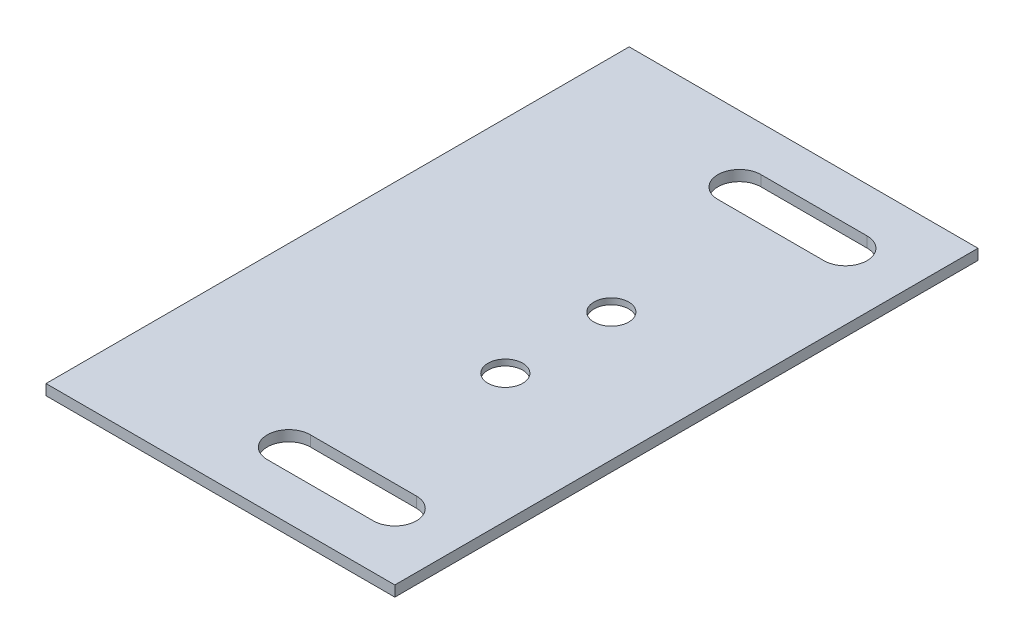
ISO-10303-21;
HEADER;
FILE_DESCRIPTION(('STEP AP214'),'2;1');
FILE_NAME('part.step','',(''),(''),'','','');
FILE_SCHEMA(('AUTOMOTIVE_DESIGN { 1 0 10303 214 1 1 1 1 }'));
ENDSEC;
DATA;
#1=APPLICATION_CONTEXT('core data for automotive mechanical design processes');
#2=APPLICATION_PROTOCOL_DEFINITION('international standard','automotive_design',2000,#1);
#3=PRODUCT_CONTEXT('',#1,'mechanical');
#4=PRODUCT('Part','Part','',(#3));
#5=PRODUCT_RELATED_PRODUCT_CATEGORY('part','',(#4));
#6=PRODUCT_DEFINITION_FORMATION('','',#4);
#7=PRODUCT_DEFINITION_CONTEXT('part definition',#1,'design');
#8=PRODUCT_DEFINITION('design','',#6,#7);
#9=PRODUCT_DEFINITION_SHAPE('','',#8);
#10=(LENGTH_UNIT() NAMED_UNIT(*) SI_UNIT(.MILLI.,.METRE.));
#11=(NAMED_UNIT(*) PLANE_ANGLE_UNIT() SI_UNIT($,.RADIAN.));
#12=(NAMED_UNIT(*) SI_UNIT($,.STERADIAN.) SOLID_ANGLE_UNIT());
#13=UNCERTAINTY_MEASURE_WITH_UNIT(LENGTH_MEASURE(1.E-05),#10,'distance_accuracy_value','');
#14=(GEOMETRIC_REPRESENTATION_CONTEXT(3) GLOBAL_UNCERTAINTY_ASSIGNED_CONTEXT((#13)) GLOBAL_UNIT_ASSIGNED_CONTEXT((#10,
#11,#12)) REPRESENTATION_CONTEXT('',''));
#15=CARTESIAN_POINT('',(0.,0.,0.));
#16=DIRECTION('',(0.,0.,1.));
#17=DIRECTION('',(1.,0.,0.));
#18=AXIS2_PLACEMENT_3D('',#15,#16,#17);
#19=CARTESIAN_POINT('',(-157.748110621059,2.54,85.5564171691216));
#20=DIRECTION('',(0.,0.,1.));
#21=DIRECTION('',(1.,0.,0.));
#22=AXIS2_PLACEMENT_3D('',#19,#20,#21);
#23=PLANE('',#22);
#24=DIRECTION('',(0.,1.,0.));
#25=VECTOR('',#24,1.);
#26=CARTESIAN_POINT('',(-17.6526892648212,-0.00100000000000013,85.5564171691217));
#27=LINE('',#26,#25);
#28=CARTESIAN_POINT('',(-17.6526892648212,0.,85.5564171691217));
#29=VERTEX_POINT('',#28);
#30=CARTESIAN_POINT('',(-17.6526892648212,2.54,85.5564171691217));
#31=VERTEX_POINT('',#30);
#32=EDGE_CURVE('E295',#29,#31,#27,.T.);
#33=ORIENTED_EDGE('',*,*,#32,.F.);
#34=DIRECTION('',(-1.,0.,0.));
#35=VECTOR('',#34,1.);
#36=CARTESIAN_POINT('',(-157.748110621059,0.,85.5564171691216));
#37=LINE('',#36,#35);
#38=CARTESIAN_POINT('',(65.9133107351787,0.,85.5564171691217));
#39=VERTEX_POINT('',#38);
#40=EDGE_CURVE('E254',#39,#29,#37,.T.);
#41=ORIENTED_EDGE('',*,*,#40,.F.);
#42=DIRECTION('',(0.,-1.,0.));
#43=VECTOR('',#42,1.);
#44=CARTESIAN_POINT('',(65.9133107351787,2.54,85.5564171691217));
#45=LINE('',#44,#43);
#46=CARTESIAN_POINT('',(65.9133107351787,2.54,85.5564171691217));
#47=VERTEX_POINT('',#46);
#48=EDGE_CURVE('E11',#47,#39,#45,.T.);
#49=ORIENTED_EDGE('',*,*,#48,.F.);
#50=DIRECTION('',(-1.,0.,0.));
#51=VECTOR('',#50,1.);
#52=CARTESIAN_POINT('',(-157.748110621059,2.54,85.5564171691216));
#53=LINE('',#52,#51);
#54=EDGE_CURVE('E144',#47,#31,#53,.T.);
#55=ORIENTED_EDGE('',*,*,#54,.T.);
#56=EDGE_LOOP('',(#33,#41,#49,#55));
#57=FACE_BOUND('',#56,.T.);
#58=ADVANCED_FACE('F34',(#57),#23,.T.);
#59=CARTESIAN_POINT('',(65.9133107351787,2.54,15.7064171691218));
#60=DIRECTION('',(1.,0.,0.));
#61=DIRECTION('',(0.,0.,-1.));
#62=AXIS2_PLACEMENT_3D('',#59,#60,#61);
#63=PLANE('',#62);
#64=DIRECTION('',(0.,0.,1.));
#65=VECTOR('',#64,1.);
#66=CARTESIAN_POINT('',(65.9133107351787,0.,15.7064171691218));
#67=LINE('',#66,#65);
#68=CARTESIAN_POINT('',(65.9133107351788,0.,-54.1435828308783));
#69=VERTEX_POINT('',#68);
#70=EDGE_CURVE('E257',#69,#39,#67,.T.);
#71=ORIENTED_EDGE('',*,*,#70,.F.);
#72=DIRECTION('',(0.,-1.,0.));
#73=VECTOR('',#72,1.);
#74=CARTESIAN_POINT('',(65.9133107351788,2.54,-54.1435828308783));
#75=LINE('',#74,#73);
#76=CARTESIAN_POINT('',(65.9133107351788,2.54,-54.1435828308783));
#77=VERTEX_POINT('',#76);
#78=EDGE_CURVE('E48',#77,#69,#75,.T.);
#79=ORIENTED_EDGE('',*,*,#78,.F.);
#80=DIRECTION('',(0.,0.,1.));
#81=VECTOR('',#80,1.);
#82=CARTESIAN_POINT('',(65.9133107351787,2.54,15.7064171691218));
#83=LINE('',#82,#81);
#84=EDGE_CURVE('E227',#77,#47,#83,.T.);
#85=ORIENTED_EDGE('',*,*,#84,.T.);
#86=ORIENTED_EDGE('',*,*,#48,.T.);
#87=EDGE_LOOP('',(#71,#79,#85,#86));
#88=FACE_BOUND('',#87,.T.);
#89=ADVANCED_FACE('F173',(#88),#63,.T.);
#90=CARTESIAN_POINT('',(50.0383107351788,2.54,-38.2685828308783));
#91=DIRECTION('',(0.,1.,0.));
#92=DIRECTION('',(0.,0.,-1.));
#93=AXIS2_PLACEMENT_3D('',#90,#91,#92);
#94=ELLIPSE('',#93,5.15620000000001,5.1562);
#95=DIRECTION('',(0.,-1.,0.));
#96=VECTOR('',#95,1.);
#97=SURFACE_OF_LINEAR_EXTRUSION('',#94,#96);
#98=CARTESIAN_POINT('',(50.0383107351788,0.,-38.2685828308783));
#99=DIRECTION('',(0.,1.,0.));
#100=DIRECTION('',(0.,0.,-1.));
#101=AXIS2_PLACEMENT_3D('',#98,#99,#100);
#102=ELLIPSE('',#101,5.15620000000001,5.1562);
#103=CARTESIAN_POINT('',(50.0383107351788,0.,-33.1123828308783));
#104=VERTEX_POINT('',#103);
#105=CARTESIAN_POINT('',(50.0383107351788,0.,-43.4247828308783));
#106=VERTEX_POINT('',#105);
#107=EDGE_CURVE('E245',#104,#106,#102,.T.);
#108=ORIENTED_EDGE('',*,*,#107,.F.);
#109=DIRECTION('',(0.,-1.,0.));
#110=VECTOR('',#109,1.);
#111=CARTESIAN_POINT('',(50.0383107351788,2.54,-33.1123828308783));
#112=LINE('',#111,#110);
#113=CARTESIAN_POINT('',(50.0383107351788,2.54,-33.1123828308783));
#114=VERTEX_POINT('',#113);
#115=EDGE_CURVE('E157',#114,#104,#112,.T.);
#116=ORIENTED_EDGE('',*,*,#115,.F.);
#117=CARTESIAN_POINT('',(50.0383107351788,2.54,-43.4247828308783));
#118=VERTEX_POINT('',#117);
#119=EDGE_CURVE('E140',#114,#118,#94,.T.);
#120=ORIENTED_EDGE('',*,*,#119,.T.);
#121=DIRECTION('',(0.,-1.,0.));
#122=VECTOR('',#121,1.);
#123=CARTESIAN_POINT('',(50.0383107351788,2.54,-43.4247828308783));
#124=LINE('',#123,#122);
#125=EDGE_CURVE('E147',#118,#106,#124,.T.);
#126=ORIENTED_EDGE('',*,*,#125,.T.);
#127=EDGE_LOOP('',(#108,#116,#120,#126));
#128=FACE_BOUND('',#127,.T.);
#129=ADVANCED_FACE('F156',(#128),#97,.T.);
#130=CARTESIAN_POINT('',(-157.748110621059,2.54,-33.1123828308784));
#131=DIRECTION('',(0.,0.,1.));
#132=DIRECTION('',(1.,0.,0.));
#133=AXIS2_PLACEMENT_3D('',#130,#131,#132);
#134=PLANE('',#133);
#135=DIRECTION('',(-1.,0.,0.));
#136=VECTOR('',#135,1.);
#137=CARTESIAN_POINT('',(-157.748110621059,0.,-33.1123828308784));
#138=LINE('',#137,#136);
#139=CARTESIAN_POINT('',(24.6383107351787,0.,-33.1123828308783));
#140=VERTEX_POINT('',#139);
#141=EDGE_CURVE('E247',#104,#140,#138,.T.);
#142=ORIENTED_EDGE('',*,*,#141,.T.);
#143=DIRECTION('',(0.,-1.,0.));
#144=VECTOR('',#143,1.);
#145=CARTESIAN_POINT('',(24.6383107351787,2.54,-33.1123828308783));
#146=LINE('',#145,#144);
#147=CARTESIAN_POINT('',(24.6383107351787,2.54,-33.1123828308783));
#148=VERTEX_POINT('',#147);
#149=EDGE_CURVE('E263',#148,#140,#146,.T.);
#150=ORIENTED_EDGE('',*,*,#149,.F.);
#151=DIRECTION('',(-1.,0.,0.));
#152=VECTOR('',#151,1.);
#153=CARTESIAN_POINT('',(-157.748110621059,2.54,-33.1123828308784));
#154=LINE('',#153,#152);
#155=EDGE_CURVE('E159',#114,#148,#154,.T.);
#156=ORIENTED_EDGE('',*,*,#155,.F.);
#157=ORIENTED_EDGE('',*,*,#115,.T.);
#158=EDGE_LOOP('',(#142,#150,#156,#157));
#159=FACE_BOUND('',#158,.T.);
#160=ADVANCED_FACE('F172',(#159),#134,.F.);
#161=CARTESIAN_POINT('',(24.6383107351788,2.54,-38.2685828308783));
#162=DIRECTION('',(0.,1.,0.));
#163=DIRECTION('',(-1.,0.,0.));
#164=AXIS2_PLACEMENT_3D('',#161,#162,#163);
#165=ELLIPSE('',#164,5.1562,5.1562);
#166=DIRECTION('',(0.,-1.,0.));
#167=VECTOR('',#166,1.);
#168=SURFACE_OF_LINEAR_EXTRUSION('',#165,#167);
#169=CARTESIAN_POINT('',(24.6383107351788,0.,-38.2685828308783));
#170=DIRECTION('',(0.,1.,0.));
#171=DIRECTION('',(-1.,0.,0.));
#172=AXIS2_PLACEMENT_3D('',#169,#170,#171);
#173=ELLIPSE('',#172,5.1562,5.1562);
#174=CARTESIAN_POINT('',(24.6383107351788,0.,-43.4247828308783));
#175=VERTEX_POINT('',#174);
#176=EDGE_CURVE('E250',#175,#140,#173,.T.);
#177=ORIENTED_EDGE('',*,*,#176,.F.);
#178=DIRECTION('',(0.,-1.,0.));
#179=VECTOR('',#178,1.);
#180=CARTESIAN_POINT('',(24.6383107351788,2.54,-43.4247828308783));
#181=LINE('',#180,#179);
#182=CARTESIAN_POINT('',(24.6383107351788,2.54,-43.4247828308783));
#183=VERTEX_POINT('',#182);
#184=EDGE_CURVE('E154',#183,#175,#181,.T.);
#185=ORIENTED_EDGE('',*,*,#184,.F.);
#186=EDGE_CURVE('E142',#183,#148,#165,.T.);
#187=ORIENTED_EDGE('',*,*,#186,.T.);
#188=ORIENTED_EDGE('',*,*,#149,.T.);
#189=EDGE_LOOP('',(#177,#185,#187,#188));
#190=FACE_BOUND('',#189,.T.);
#191=ADVANCED_FACE('F198',(#190),#168,.T.);
#192=CARTESIAN_POINT('',(50.0383107351787,2.54,69.6814171691217));
#193=DIRECTION('',(0.,1.,0.));
#194=DIRECTION('',(-1.,0.,0.));
#195=AXIS2_PLACEMENT_3D('',#192,#193,#194);
#196=ELLIPSE('',#195,5.15620000000001,5.1562);
#197=DIRECTION('',(0.,-1.,0.));
#198=VECTOR('',#197,1.);
#199=SURFACE_OF_LINEAR_EXTRUSION('',#196,#198);
#200=CARTESIAN_POINT('',(50.0383107351787,0.,69.6814171691217));
#201=DIRECTION('',(0.,1.,0.));
#202=DIRECTION('',(-1.,0.,0.));
#203=AXIS2_PLACEMENT_3D('',#200,#201,#202);
#204=ELLIPSE('',#203,5.15620000000001,5.1562);
#205=CARTESIAN_POINT('',(50.0383107351787,0.,74.8376171691217));
#206=VERTEX_POINT('',#205);
#207=CARTESIAN_POINT('',(50.0383107351787,0.,64.5252171691217));
#208=VERTEX_POINT('',#207);
#209=EDGE_CURVE('E232',#206,#208,#204,.T.);
#210=ORIENTED_EDGE('',*,*,#209,.F.);
#211=DIRECTION('',(0.,-1.,0.));
#212=VECTOR('',#211,1.);
#213=CARTESIAN_POINT('',(50.0383107351787,2.54,74.8376171691217));
#214=LINE('',#213,#212);
#215=CARTESIAN_POINT('',(50.0383107351787,2.54,74.8376171691217));
#216=VERTEX_POINT('',#215);
#217=EDGE_CURVE('E110',#216,#206,#214,.T.);
#218=ORIENTED_EDGE('',*,*,#217,.F.);
#219=CARTESIAN_POINT('',(50.0383107351787,2.54,64.5252171691217));
#220=VERTEX_POINT('',#219);
#221=EDGE_CURVE('E191',#216,#220,#196,.T.);
#222=ORIENTED_EDGE('',*,*,#221,.T.);
#223=DIRECTION('',(0.,-1.,0.));
#224=VECTOR('',#223,1.);
#225=CARTESIAN_POINT('',(50.0383107351787,2.54,64.5252171691217));
#226=LINE('',#225,#224);
#227=EDGE_CURVE('E231',#220,#208,#226,.T.);
#228=ORIENTED_EDGE('',*,*,#227,.T.);
#229=EDGE_LOOP('',(#210,#218,#222,#228));
#230=FACE_BOUND('',#229,.T.);
#231=ADVANCED_FACE('F196',(#230),#199,.T.);
#232=CARTESIAN_POINT('',(-157.748110621059,2.54,74.8376171691217));
#233=DIRECTION('',(0.,0.,1.));
#234=DIRECTION('',(1.,0.,0.));
#235=AXIS2_PLACEMENT_3D('',#232,#233,#234);
#236=PLANE('',#235);
#237=DIRECTION('',(-1.,0.,0.));
#238=VECTOR('',#237,1.);
#239=CARTESIAN_POINT('',(-157.748110621059,0.,74.8376171691217));
#240=LINE('',#239,#238);
#241=CARTESIAN_POINT('',(24.6383107351787,0.,74.8376171691217));
#242=VERTEX_POINT('',#241);
#243=EDGE_CURVE('E235',#206,#242,#240,.T.);
#244=ORIENTED_EDGE('',*,*,#243,.T.);
#245=DIRECTION('',(0.,-1.,0.));
#246=VECTOR('',#245,1.);
#247=CARTESIAN_POINT('',(24.6383107351787,2.54,74.8376171691217));
#248=LINE('',#247,#246);
#249=CARTESIAN_POINT('',(24.6383107351787,2.54,74.8376171691217));
#250=VERTEX_POINT('',#249);
#251=EDGE_CURVE('E269',#250,#242,#248,.T.);
#252=ORIENTED_EDGE('',*,*,#251,.F.);
#253=DIRECTION('',(-1.,0.,0.));
#254=VECTOR('',#253,1.);
#255=CARTESIAN_POINT('',(-157.748110621059,2.54,74.8376171691217));
#256=LINE('',#255,#254);
#257=EDGE_CURVE('E189',#216,#250,#256,.T.);
#258=ORIENTED_EDGE('',*,*,#257,.F.);
#259=ORIENTED_EDGE('',*,*,#217,.T.);
#260=EDGE_LOOP('',(#244,#252,#258,#259));
#261=FACE_BOUND('',#260,.T.);
#262=ADVANCED_FACE('F183',(#261),#236,.F.);
#263=CARTESIAN_POINT('',(24.6383107351787,2.54,69.6814171691217));
#264=DIRECTION('',(0.,1.,0.));
#265=DIRECTION('',(-1.,0.,0.));
#266=AXIS2_PLACEMENT_3D('',#263,#264,#265);
#267=ELLIPSE('',#266,5.1562,5.1562);
#268=DIRECTION('',(0.,-1.,0.));
#269=VECTOR('',#268,1.);
#270=SURFACE_OF_LINEAR_EXTRUSION('',#267,#269);
#271=CARTESIAN_POINT('',(24.6383107351787,0.,69.6814171691217));
#272=DIRECTION('',(0.,1.,0.));
#273=DIRECTION('',(-1.,0.,0.));
#274=AXIS2_PLACEMENT_3D('',#271,#272,#273);
#275=ELLIPSE('',#274,5.1562,5.1562);
#276=CARTESIAN_POINT('',(24.6383107351787,0.,64.5252171691217));
#277=VERTEX_POINT('',#276);
#278=EDGE_CURVE('E239',#277,#242,#275,.T.);
#279=ORIENTED_EDGE('',*,*,#278,.F.);
#280=DIRECTION('',(0.,-1.,0.));
#281=VECTOR('',#280,1.);
#282=CARTESIAN_POINT('',(24.6383107351787,2.54,64.5252171691217));
#283=LINE('',#282,#281);
#284=CARTESIAN_POINT('',(24.6383107351787,2.54,64.5252171691217));
#285=VERTEX_POINT('',#284);
#286=EDGE_CURVE('E267',#285,#277,#283,.T.);
#287=ORIENTED_EDGE('',*,*,#286,.F.);
#288=EDGE_CURVE('E163',#285,#250,#267,.T.);
#289=ORIENTED_EDGE('',*,*,#288,.T.);
#290=ORIENTED_EDGE('',*,*,#251,.T.);
#291=EDGE_LOOP('',(#279,#287,#289,#290));
#292=FACE_BOUND('',#291,.T.);
#293=ADVANCED_FACE('F180',(#292),#270,.T.);
#294=CARTESIAN_POINT('',(-157.748110621059,2.54,-43.4247828308784));
#295=DIRECTION('',(0.,0.,-1.));
#296=DIRECTION('',(-1.,0.,0.));
#297=AXIS2_PLACEMENT_3D('',#294,#295,#296);
#298=PLANE('',#297);
#299=DIRECTION('',(1.,0.,0.));
#300=VECTOR('',#299,1.);
#301=CARTESIAN_POINT('',(-157.748110621059,0.,-43.4247828308784));
#302=LINE('',#301,#300);
#303=EDGE_CURVE('E150',#175,#106,#302,.T.);
#304=ORIENTED_EDGE('',*,*,#303,.T.);
#305=ORIENTED_EDGE('',*,*,#125,.F.);
#306=DIRECTION('',(1.,0.,0.));
#307=VECTOR('',#306,1.);
#308=CARTESIAN_POINT('',(-157.748110621059,2.54,-43.4247828308784));
#309=LINE('',#308,#307);
#310=EDGE_CURVE('E136',#183,#118,#309,.T.);
#311=ORIENTED_EDGE('',*,*,#310,.F.);
#312=ORIENTED_EDGE('',*,*,#184,.T.);
#313=EDGE_LOOP('',(#304,#305,#311,#312));
#314=FACE_BOUND('',#313,.T.);
#315=ADVANCED_FACE('F148',(#314),#298,.F.);
#316=CARTESIAN_POINT('',(-157.748110621059,2.54,64.5252171691218));
#317=DIRECTION('',(0.,0.,-1.));
#318=DIRECTION('',(-1.,0.,0.));
#319=AXIS2_PLACEMENT_3D('',#316,#317,#318);
#320=PLANE('',#319);
#321=DIRECTION('',(1.,0.,0.));
#322=VECTOR('',#321,1.);
#323=CARTESIAN_POINT('',(-157.748110621059,0.,64.5252171691218));
#324=LINE('',#323,#322);
#325=EDGE_CURVE('E242',#277,#208,#324,.T.);
#326=ORIENTED_EDGE('',*,*,#325,.T.);
#327=ORIENTED_EDGE('',*,*,#227,.F.);
#328=DIRECTION('',(1.,0.,0.));
#329=VECTOR('',#328,1.);
#330=CARTESIAN_POINT('',(-157.748110621059,2.54,64.5252171691218));
#331=LINE('',#330,#329);
#332=EDGE_CURVE('E160',#285,#220,#331,.T.);
#333=ORIENTED_EDGE('',*,*,#332,.F.);
#334=ORIENTED_EDGE('',*,*,#286,.T.);
#335=EDGE_LOOP('',(#326,#327,#333,#334));
#336=FACE_BOUND('',#335,.T.);
#337=ADVANCED_FACE('F175',(#336),#320,.F.);
#338=CARTESIAN_POINT('',(35.2301107351787,2.54,28.4064171691217));
#339=DIRECTION('',(0.,1.,0.));
#340=DIRECTION('',(0.,0.,1.));
#341=AXIS2_PLACEMENT_3D('',#338,#339,#340);
#342=ELLIPSE('',#341,4.1656,4.16559999999999);
#343=DIRECTION('',(0.,-1.,0.));
#344=VECTOR('',#343,1.);
#345=SURFACE_OF_LINEAR_EXTRUSION('',#342,#344);
#346=CARTESIAN_POINT('',(35.2301107351787,1.08916813630355,32.5720171691217));
#347=CARTESIAN_POINT('',(35.460838307923,1.08916813630355,32.5720058971414));
#348=CARTESIAN_POINT('',(35.6918081051648,1.08916813630355,32.5527768996483));
#349=CARTESIAN_POINT('',(36.1472502549061,1.08916813630355,32.4763645331215));
#350=CARTESIAN_POINT('',(36.3717226074056,1.08916813630355,32.4191811640878));
#351=CARTESIAN_POINT('',(36.8081424483046,1.08916813630355,32.2684504546352));
#352=CARTESIAN_POINT('',(37.020089936704,1.08916813630355,32.1749031142164));
#353=CARTESIAN_POINT('',(37.4255703509009,1.08916813630355,31.9540210863768));
#354=CARTESIAN_POINT('',(37.6191032766985,1.08916813630355,31.8266863989562));
#355=CARTESIAN_POINT('',(37.9824284274324,1.08916813630355,31.5417426888196));
#356=CARTESIAN_POINT('',(38.1522206523689,1.08916813630355,31.3841336661036));
#357=CARTESIAN_POINT('',(38.4633781494147,1.08916813630355,31.0429881022386));
#358=CARTESIAN_POINT('',(38.604743421524,1.08916813630355,30.8594515610895));
#359=CARTESIAN_POINT('',(38.8551488112392,1.08916813630355,30.4715132155013));
#360=CARTESIAN_POINT('',(38.964188928845,1.08916813630355,30.2671114110623));
#361=CARTESIAN_POINT('',(39.1469363087287,1.08916813630355,29.8430802000279));
#362=CARTESIAN_POINT('',(39.2206435710064,1.08916813630355,29.6234507934326));
#363=CARTESIAN_POINT('',(39.3306923544694,1.08916813630355,29.1750220602947));
#364=CARTESIAN_POINT('',(39.3670338756546,1.08916813630355,28.946222733752));
#365=CARTESIAN_POINT('',(39.4013488121744,1.08916813630355,28.4857647555777));
#366=CARTESIAN_POINT('',(39.399322227509,1.08916813630355,28.254106103946));
#367=CARTESIAN_POINT('',(39.3569568526384,1.08916813630355,27.7943189361817));
#368=CARTESIAN_POINT('',(39.3166180624331,1.08916813630355,27.566190420049));
#369=CARTESIAN_POINT('',(39.198740873936,1.08916813630355,27.1197556174945));
#370=CARTESIAN_POINT('',(39.1212024756441,1.08916813630355,26.9014493310725));
#371=CARTESIAN_POINT('',(38.9310646856192,1.08916813630355,26.4806801718349));
#372=CARTESIAN_POINT('',(38.8184652938862,1.08916813630355,26.2782172990192));
#373=CARTESIAN_POINT('',(38.5613111610452,1.08916813630355,25.8947191679928));
#374=CARTESIAN_POINT('',(38.4167564199372,1.08916813630355,25.713683909782));
#375=CARTESIAN_POINT('',(38.0996786044542,1.08916813630355,25.3780342062601));
#376=CARTESIAN_POINT('',(37.9271555300792,1.08916813630355,25.223419760949));
#377=CARTESIAN_POINT('',(37.5588994687581,1.08916813630355,24.9448761596158));
#378=CARTESIAN_POINT('',(37.3631664818121,1.08916813630355,24.8209470035938));
#379=CARTESIAN_POINT('',(36.9538891769636,1.08916813630355,24.6071921152754));
#380=CARTESIAN_POINT('',(36.7403448590611,1.08916813630355,24.517366382979));
#381=CARTESIAN_POINT('',(36.3013347346104,1.08916813630355,24.3742958578046));
#382=CARTESIAN_POINT('',(36.0758689280622,1.08916813630355,24.3210510649266));
#383=CARTESIAN_POINT('',(35.6192344794793,1.08916813630355,24.2526109822905));
#384=CARTESIAN_POINT('',(35.3880658374445,1.08916813630355,24.2374156925324));
#385=CARTESIAN_POINT('',(34.9264016629953,1.08916813630355,24.2454937228649));
#386=CARTESIAN_POINT('',(34.6959061305809,1.08916813630355,24.2687670429556));
#387=CARTESIAN_POINT('',(34.2419455552019,1.08916813630355,24.3531403832092));
#388=CARTESIAN_POINT('',(34.0184805122374,1.08916813630355,24.4142404033721));
#389=CARTESIAN_POINT('',(33.5847443851403,1.08916813630355,24.5725819222316));
#390=CARTESIAN_POINT('',(33.3744733010078,1.08916813630355,24.6698234209282));
#391=CARTESIAN_POINT('',(32.9729246536527,1.08916813630355,24.8977658442532));
#392=CARTESIAN_POINT('',(32.7816470904302,1.08916813630355,25.0284667688816));
#393=CARTESIAN_POINT('',(32.4233611798715,1.08916813630355,25.3197231350591));
#394=CARTESIAN_POINT('',(32.2563528325354,1.08916813630355,25.4802785766082));
#395=CARTESIAN_POINT('',(31.9512116707874,1.08916813630355,25.8268156394907));
#396=CARTESIAN_POINT('',(31.8130788563755,1.08916813630355,26.0127972608242));
#397=CARTESIAN_POINT('',(31.5694986511107,1.08916813630355,26.4050570575747));
#398=CARTESIAN_POINT('',(31.4640512602577,1.08916813630355,26.6113352329916));
#399=CARTESIAN_POINT('',(31.2887502843286,1.08916813630355,27.0384987056586));
#400=CARTESIAN_POINT('',(31.2188966992526,1.08916813630355,27.2593840029086));
#401=CARTESIAN_POINT('',(31.1167099917522,1.08916813630355,27.7096694028151));
#402=CARTESIAN_POINT('',(31.0843768693279,1.08916813630355,27.9390695054716));
#403=CARTESIAN_POINT('',(31.0581228780847,1.08916813630355,28.4000573495597));
#404=CARTESIAN_POINT('',(31.0642020092658,1.08916813630355,28.6316450909913));
#405=CARTESIAN_POINT('',(31.114604856315,1.08916813630355,29.0906207090962));
#406=CARTESIAN_POINT('',(31.1589285721831,1.08916813630355,29.3180085857695));
#407=CARTESIAN_POINT('',(31.284598073697,1.08916813630355,29.7623128045201));
#408=CARTESIAN_POINT('',(31.3659438593428,1.08916813630355,29.9792291465973));
#409=CARTESIAN_POINT('',(31.5634138979,1.08916813630355,30.3966074614311));
#410=CARTESIAN_POINT('',(31.6795381508114,1.08916813630355,30.5970694341878));
#411=CARTESIAN_POINT('',(31.943362166979,1.08916813630355,30.9760099499182));
#412=CARTESIAN_POINT('',(32.0910619302352,1.08916813630355,31.1544884928919));
#413=CARTESIAN_POINT('',(32.4139635515389,1.08916813630355,31.4845396438413));
#414=CARTESIAN_POINT('',(32.5891654095864,1.08916813630355,31.636112251817));
#415=CARTESIAN_POINT('',(32.9622376295343,1.08916813630355,31.9081702997866));
#416=CARTESIAN_POINT('',(33.1601079914346,1.08916813630355,32.0286557397804));
#417=CARTESIAN_POINT('',(33.5730644842353,1.08916813630355,32.2352187427112));
#418=CARTESIAN_POINT('',(33.7881506151357,1.08916813630355,32.3212963056481));
#419=CARTESIAN_POINT('',(34.2042141615264,1.08916813630355,32.4488794661423));
#420=CARTESIAN_POINT('',(34.4039709206143,1.08916813630355,32.4943715139968));
#421=CARTESIAN_POINT('',(34.7088391822651,1.08916813630355,32.5405880575892));
#422=CARTESIAN_POINT('',(34.8123798708878,1.08916813630355,32.5523259854399));
#423=CARTESIAN_POINT('',(35.0206317660735,1.08916813630355,32.5680652555525));
#424=CARTESIAN_POINT('',(35.1253462807157,1.08916813630355,32.5720222872914));
#425=CARTESIAN_POINT('',(35.2301107351787,1.08916813630355,32.5720171691217));
#426=B_SPLINE_CURVE_WITH_KNOTS('',3,(#346,#347,#348,#349,#350,#351,#352,#353,#354,#355,#356,
#357,#358,#359,#360,#361,#362,#363,#364,#365,#366,#367,#368,#369,#370,#371,#372,#373,#374,#375,
#376,#377,#378,#379,#380,#381,#382,#383,#384,#385,#386,#387,#388,#389,#390,#391,#392,#393,#394,
#395,#396,#397,#398,#399,#400,#401,#402,#403,#404,#405,#406,#407,#408,#409,#410,#411,#412,#413,
#414,#415,#416,#417,#418,#419,#420,#421,#422,#423,#424,#425),.UNSPECIFIED.,.T.,.F.,(4,2,2,2,2,2,
2,2,2,2,2,2,2,2,2,2,2,2,2,2,2,2,2,2,2,2,2,2,2,2,2,2,2,2,2,2,2,2,2,4),(0.,0.691807695129804,
1.38361539025919,2.07542308538857,2.76723078051795,3.45903847564733,4.15084617077671,
4.84265386590609,5.53446156103547,6.22626925616485,6.91807695129423,7.60988464642361,
8.30169234155299,8.99350003668237,9.68530773181175,10.3771154269411,11.0689231220705,
11.7607308171999,12.4525385123293,13.1443462074586,13.836153902588,14.5279615977174,
15.2197692928468,15.9115769879762,16.6033846831055,17.2951923782349,17.9870000733643,
18.6788077684937,19.370615463623,20.0624231587524,20.7542308538818,21.4460385490112,
22.1378462441406,22.8296539392699,23.5214616343993,24.2132693295287,24.9050770246581,
25.5173533583335,25.8297027689544,26.1438258488775),.UNSPECIFIED.);
#427=CARTESIAN_POINT('',(35.2301107351787,1.08916813630355,32.5720171691217));
#428=VERTEX_POINT('',#427);
#429=EDGE_CURVE('E40',#428,#428,#426,.T.);
#430=ORIENTED_EDGE('',*,*,#429,.F.);
#431=EDGE_LOOP('',(#430));
#432=FACE_BOUND('',#431,.T.);
#433=CARTESIAN_POINT('',(35.2301107351787,2.54,32.5720171691217));
#434=VERTEX_POINT('',#433);
#435=EDGE_CURVE('E194',#434,#434,#342,.T.);
#436=ORIENTED_EDGE('',*,*,#435,.T.);
#437=EDGE_LOOP('',(#436));
#438=FACE_BOUND('',#437,.T.);
#439=ADVANCED_FACE('F178',(#432,#438),#345,.T.);
#440=CARTESIAN_POINT('',(35.2301107351787,2.54,3.00641716912172));
#441=DIRECTION('',(0.,1.,0.));
#442=DIRECTION('',(-1.,0.,0.));
#443=AXIS2_PLACEMENT_3D('',#440,#441,#442);
#444=ELLIPSE('',#443,4.1656,4.1656);
#445=DIRECTION('',(0.,-1.,0.));
#446=VECTOR('',#445,1.);
#447=SURFACE_OF_LINEAR_EXTRUSION('',#444,#446);
#448=CARTESIAN_POINT('',(31.0645107351787,1.08916813630355,3.00641716912172));
#449=CARTESIAN_POINT('',(31.064522007159,1.08916813630355,3.23714474186604));
#450=CARTESIAN_POINT('',(31.0837510046521,1.08916813630355,3.46811453910781));
#451=CARTESIAN_POINT('',(31.1601633711789,1.08916813630355,3.92355668884908));
#452=CARTESIAN_POINT('',(31.2173467402126,1.08916813630355,4.1480290413486));
#453=CARTESIAN_POINT('',(31.3680774496652,1.08916813630355,4.58444888224755));
#454=CARTESIAN_POINT('',(31.4616247900841,1.08916813630355,4.79639637064698));
#455=CARTESIAN_POINT('',(31.6825068179236,1.08916813630355,5.20187678484394));
#456=CARTESIAN_POINT('',(31.8098415053443,1.08916813630355,5.39540971064146));
#457=CARTESIAN_POINT('',(32.0947852154809,1.08916813630355,5.75873486137544));
#458=CARTESIAN_POINT('',(32.2523942381968,1.08916813630355,5.92852708631189));
#459=CARTESIAN_POINT('',(32.5935398020619,1.08916813630355,6.23968458335769));
#460=CARTESIAN_POINT('',(32.777076343211,1.08916813630355,6.38104985546703));
#461=CARTESIAN_POINT('',(33.1650146887991,1.08916813630355,6.63145524518222));
#462=CARTESIAN_POINT('',(33.3694164932382,1.08916813630355,6.74049536278806));
#463=CARTESIAN_POINT('',(33.7934477042725,1.08916813630355,6.92324274267168));
#464=CARTESIAN_POINT('',(34.0130771108678,1.08916813630355,6.99695000494946));
#465=CARTESIAN_POINT('',(34.4615058440058,1.08916813630355,7.10699878841244));
#466=CARTESIAN_POINT('',(34.6903051705485,1.08916813630355,7.14334030959764));
#467=CARTESIAN_POINT('',(35.1507631487228,1.08916813630355,7.17765524611744));
#468=CARTESIAN_POINT('',(35.3824218003545,1.08916813630355,7.17562866145203));
#469=CARTESIAN_POINT('',(35.8422089681188,1.08916813630355,7.13326328658137));
#470=CARTESIAN_POINT('',(36.0703374842515,1.08916813630355,7.09292449637614));
#471=CARTESIAN_POINT('',(36.516772286806,1.08916813630355,6.975047307879));
#472=CARTESIAN_POINT('',(36.7350785732279,1.08916813630355,6.8975089095871));
#473=CARTESIAN_POINT('',(37.1558477324656,1.08916813630355,6.70737111956219));
#474=CARTESIAN_POINT('',(37.3583106052812,1.08916813630355,6.59477172782917));
#475=CARTESIAN_POINT('',(37.7418087363077,1.08916813630355,6.33761759498817));
#476=CARTESIAN_POINT('',(37.9228439945185,1.08916813630355,6.19306285388018));
#477=CARTESIAN_POINT('',(38.2584936980404,1.08916813630355,5.87598503839719));
#478=CARTESIAN_POINT('',(38.4131081433515,1.08916813630355,5.70346196402218));
#479=CARTESIAN_POINT('',(38.6916517446846,1.08916813630355,5.33520590270112));
#480=CARTESIAN_POINT('',(38.8155809007067,1.08916813630355,5.13947291575507));
#481=CARTESIAN_POINT('',(39.0293357890251,1.08916813630355,4.73019561090654));
#482=CARTESIAN_POINT('',(39.1191615213215,1.08916813630355,4.51665129300408));
#483=CARTESIAN_POINT('',(39.2622320464959,1.08916813630355,4.07764116855341));
#484=CARTESIAN_POINT('',(39.3154768393739,1.08916813630355,3.85217536200521));
#485=CARTESIAN_POINT('',(39.38391692201,1.08916813630355,3.39554091342222));
#486=CARTESIAN_POINT('',(39.3991122117681,1.08916813630355,3.16437227138743));
#487=CARTESIAN_POINT('',(39.3910341814355,1.08916813630355,2.70270809693824));
#488=CARTESIAN_POINT('',(39.3677608613448,1.08916813630355,2.47221256452384));
#489=CARTESIAN_POINT('',(39.2833875210913,1.08916813630355,2.0182519891449));
#490=CARTESIAN_POINT('',(39.2222875009284,1.08916813630355,1.79478694618037));
#491=CARTESIAN_POINT('',(39.0639459820689,1.08916813630355,1.36105081908329));
#492=CARTESIAN_POINT('',(38.9667044833723,1.08916813630355,1.15077973495075));
#493=CARTESIAN_POINT('',(38.7387620600473,1.08916813630355,0.7492310875957));
#494=CARTESIAN_POINT('',(38.6080611354188,1.08916813630355,0.557953524373192));
#495=CARTESIAN_POINT('',(38.3168047692413,1.08916813630355,0.199667613814504));
#496=CARTESIAN_POINT('',(38.1562493276923,1.08916813630355,0.0326592664783252));
#497=CARTESIAN_POINT('',(37.8097122648097,1.08916813630355,-0.272481895269688));
#498=CARTESIAN_POINT('',(37.6237306434762,1.08916813630355,-0.410614709681522));
#499=CARTESIAN_POINT('',(37.2314708467257,1.08916813630355,-0.654194914946331));
#500=CARTESIAN_POINT('',(37.0251926713088,1.08916813630355,-0.759642305799306));
#501=CARTESIAN_POINT('',(36.5980291986418,1.08916813630355,-0.934943281728378));
#502=CARTESIAN_POINT('',(36.3771439013918,1.08916813630355,-1.00479686680448));
#503=CARTESIAN_POINT('',(35.9268585014853,1.08916813630355,-1.10698357430485));
#504=CARTESIAN_POINT('',(35.6974583988288,1.08916813630355,-1.13931669672913));
#505=CARTESIAN_POINT('',(35.2364705547407,1.08916813630355,-1.1655706879723));
#506=CARTESIAN_POINT('',(35.0048828133091,1.08916813630355,-1.1594915567912));
#507=CARTESIAN_POINT('',(34.5459071952042,1.08916813630355,-1.10908870974201));
#508=CARTESIAN_POINT('',(34.3185193185309,1.08916813630355,-1.06476499387393));
#509=CARTESIAN_POINT('',(33.8742150997803,1.08916813630355,-0.939095492360015));
#510=CARTESIAN_POINT('',(33.6572987577031,1.08916813630355,-0.857749706714185));
#511=CARTESIAN_POINT('',(33.2399204428692,1.08916813630355,-0.660279668156958));
#512=CARTESIAN_POINT('',(33.0394584701126,1.08916813630355,-0.54415541524556));
#513=CARTESIAN_POINT('',(32.6605179543822,1.08916813630355,-0.28033139907795));
#514=CARTESIAN_POINT('',(32.4820394114085,1.08916813630355,-0.132631635821737));
#515=CARTESIAN_POINT('',(32.1519882604591,1.08916813630355,0.19026998548199));
#516=CARTESIAN_POINT('',(32.0004156524833,1.08916813630355,0.365471843529504));
#517=CARTESIAN_POINT('',(31.7283576045138,1.08916813630355,0.73854406347734));
#518=CARTESIAN_POINT('',(31.60787216452,1.08916813630355,0.93641442537766));
#519=CARTESIAN_POINT('',(31.4013091615892,1.08916813630355,1.34937091817839));
#520=CARTESIAN_POINT('',(31.3152315986523,1.08916813630355,1.5644570490788));
#521=CARTESIAN_POINT('',(31.1876484381582,1.08916813630355,1.98052059546944));
#522=CARTESIAN_POINT('',(31.1421563903036,1.08916813630355,2.18027735455737));
#523=CARTESIAN_POINT('',(31.0959398467112,1.08916813630355,2.48514561620811));
#524=CARTESIAN_POINT('',(31.0842019188605,1.08916813630355,2.58868630483085));
#525=CARTESIAN_POINT('',(31.0684626487479,1.08916813630355,2.79693820001651));
#526=CARTESIAN_POINT('',(31.0645056170091,1.08916813630355,2.90165271465866));
#527=CARTESIAN_POINT('',(31.0645107351787,1.08916813630355,3.00641716912172));
#528=B_SPLINE_CURVE_WITH_KNOTS('',3,(#448,#449,#450,#451,#452,#453,#454,#455,#456,#457,#458,
#459,#460,#461,#462,#463,#464,#465,#466,#467,#468,#469,#470,#471,#472,#473,#474,#475,#476,#477,
#478,#479,#480,#481,#482,#483,#484,#485,#486,#487,#488,#489,#490,#491,#492,#493,#494,#495,#496,
#497,#498,#499,#500,#501,#502,#503,#504,#505,#506,#507,#508,#509,#510,#511,#512,#513,#514,#515,
#516,#517,#518,#519,#520,#521,#522,#523,#524,#525,#526,#527),.UNSPECIFIED.,.T.,.F.,(4,2,2,2,2,2,
2,2,2,2,2,2,2,2,2,2,2,2,2,2,2,2,2,2,2,2,2,2,2,2,2,2,2,2,2,2,2,2,2,4),(0.,0.691807695129798,
1.38361539025919,2.07542308538857,2.76723078051796,3.45903847564734,4.15084617077673,
4.84265386590611,5.53446156103549,6.22626925616488,6.91807695129426,7.60988464642365,
8.30169234155302,8.99350003668241,9.68530773181179,10.3771154269412,11.0689231220705,
11.7607308171999,12.4525385123293,13.1443462074587,13.8361539025881,14.5279615977175,
15.2197692928468,15.9115769879762,16.6033846831056,17.295192378235,17.9870000733644,
18.6788077684937,19.3706154636231,20.0624231587525,20.7542308538819,21.4460385490113,
22.1378462441407,22.8296539392701,23.5214616343994,24.2132693295288,24.9050770246582,
25.5173533583336,25.8297027689545,26.1438258488775),.UNSPECIFIED.);
#529=CARTESIAN_POINT('',(31.0645107351787,1.08916813630355,3.00641716912172));
#530=VERTEX_POINT('',#529);
#531=EDGE_CURVE('E236',#530,#530,#528,.T.);
#532=ORIENTED_EDGE('',*,*,#531,.F.);
#533=EDGE_LOOP('',(#532));
#534=FACE_BOUND('',#533,.T.);
#535=CARTESIAN_POINT('',(31.0645107351787,2.54,3.00641716912172));
#536=VERTEX_POINT('',#535);
#537=EDGE_CURVE('E260',#536,#536,#444,.T.);
#538=ORIENTED_EDGE('',*,*,#537,.T.);
#539=EDGE_LOOP('',(#538));
#540=FACE_BOUND('',#539,.T.);
#541=ADVANCED_FACE('F36',(#534,#540),#447,.T.);
#542=CARTESIAN_POINT('',(-157.748110621059,2.54,-54.1435828308784));
#543=DIRECTION('',(0.,0.,-1.));
#544=DIRECTION('',(-1.,0.,0.));
#545=AXIS2_PLACEMENT_3D('',#542,#543,#544);
#546=PLANE('',#545);
#547=DIRECTION('',(0.,1.,0.));
#548=VECTOR('',#547,1.);
#549=CARTESIAN_POINT('',(-17.6526892648213,-0.00100000000000013,-54.1435828308783));
#550=LINE('',#549,#548);
#551=CARTESIAN_POINT('',(-17.6526892648212,0.,-54.1435828308783));
#552=VERTEX_POINT('',#551);
#553=CARTESIAN_POINT('',(-17.6526892648213,2.54,-54.1435828308783));
#554=VERTEX_POINT('',#553);
#555=EDGE_CURVE('E56',#552,#554,#550,.T.);
#556=ORIENTED_EDGE('',*,*,#555,.T.);
#557=DIRECTION('',(1.,0.,0.));
#558=VECTOR('',#557,1.);
#559=CARTESIAN_POINT('',(-157.748110621059,2.54,-54.1435828308784));
#560=LINE('',#559,#558);
#561=EDGE_CURVE('E64',#554,#77,#560,.T.);
#562=ORIENTED_EDGE('',*,*,#561,.T.);
#563=ORIENTED_EDGE('',*,*,#78,.T.);
#564=DIRECTION('',(1.,0.,0.));
#565=VECTOR('',#564,1.);
#566=CARTESIAN_POINT('',(-157.748110621059,0.,-54.1435828308784));
#567=LINE('',#566,#565);
#568=EDGE_CURVE('E103',#552,#69,#567,.T.);
#569=ORIENTED_EDGE('',*,*,#568,.F.);
#570=EDGE_LOOP('',(#556,#562,#563,#569));
#571=FACE_BOUND('',#570,.T.);
#572=ADVANCED_FACE('F205',(#571),#546,.T.);
#573=CARTESIAN_POINT('',(-157.748110621059,2.54,15.7064171691217));
#574=DIRECTION('',(0.,1.,0.));
#575=DIRECTION('',(0.,0.,1.));
#576=AXIS2_PLACEMENT_3D('',#573,#574,#575);
#577=PLANE('',#576);
#578=DIRECTION('',(0.,0.,-1.));
#579=VECTOR('',#578,1.);
#580=CARTESIAN_POINT('',(-17.6526892648212,2.54,85.5564171691217));
#581=LINE('',#580,#579);
#582=EDGE_CURVE('E296',#31,#554,#581,.T.);
#583=ORIENTED_EDGE('',*,*,#582,.F.);
#584=ORIENTED_EDGE('',*,*,#54,.F.);
#585=ORIENTED_EDGE('',*,*,#84,.F.);
#586=ORIENTED_EDGE('',*,*,#561,.F.);
#587=EDGE_LOOP('',(#583,#584,#585,#586));
#588=FACE_BOUND('',#587,.T.);
#589=ORIENTED_EDGE('',*,*,#537,.F.);
#590=EDGE_LOOP('',(#589));
#591=FACE_BOUND('',#590,.T.);
#592=ORIENTED_EDGE('',*,*,#435,.F.);
#593=EDGE_LOOP('',(#592));
#594=FACE_BOUND('',#593,.T.);
#595=ORIENTED_EDGE('',*,*,#221,.F.);
#596=ORIENTED_EDGE('',*,*,#257,.T.);
#597=ORIENTED_EDGE('',*,*,#288,.F.);
#598=ORIENTED_EDGE('',*,*,#332,.T.);
#599=EDGE_LOOP('',(#595,#596,#597,#598));
#600=FACE_BOUND('',#599,.T.);
#601=ORIENTED_EDGE('',*,*,#119,.F.);
#602=ORIENTED_EDGE('',*,*,#155,.T.);
#603=ORIENTED_EDGE('',*,*,#186,.F.);
#604=ORIENTED_EDGE('',*,*,#310,.T.);
#605=EDGE_LOOP('',(#601,#602,#603,#604));
#606=FACE_BOUND('',#605,.T.);
#607=ADVANCED_FACE('F138',(#588,#591,#594,#600,#606),#577,.T.);
#608=CARTESIAN_POINT('',(-157.748110621059,0.,15.7064171691217));
#609=DIRECTION('',(0.,1.,0.));
#610=DIRECTION('',(0.,0.,1.));
#611=AXIS2_PLACEMENT_3D('',#608,#609,#610);
#612=PLANE('',#611);
#613=CARTESIAN_POINT('',(35.2301107351787,0.,28.4064171691217));
#614=DIRECTION('',(0.,-1.,0.));
#615=DIRECTION('',(0.,0.,-1.));
#616=AXIS2_PLACEMENT_3D('',#613,#614,#615);
#617=CIRCLE('',#616,7.62);
#618=CARTESIAN_POINT('',(35.2301107351787,0.,20.7864171691217));
#619=VERTEX_POINT('',#618);
#620=EDGE_CURVE('E307',#619,#619,#617,.T.);
#621=ORIENTED_EDGE('',*,*,#620,.F.);
#622=EDGE_LOOP('',(#621));
#623=FACE_BOUND('',#622,.T.);
#624=CARTESIAN_POINT('',(35.2301107351787,0.,3.00641716912172));
#625=DIRECTION('',(0.,-1.,0.));
#626=DIRECTION('',(0.,0.,-1.));
#627=AXIS2_PLACEMENT_3D('',#624,#625,#626);
#628=CIRCLE('',#627,7.62);
#629=CARTESIAN_POINT('',(35.2301107351787,0.,-4.61358283087829));
#630=VERTEX_POINT('',#629);
#631=EDGE_CURVE('E275',#630,#630,#628,.T.);
#632=ORIENTED_EDGE('',*,*,#631,.F.);
#633=EDGE_LOOP('',(#632));
#634=FACE_BOUND('',#633,.T.);
#635=ORIENTED_EDGE('',*,*,#209,.T.);
#636=ORIENTED_EDGE('',*,*,#325,.F.);
#637=ORIENTED_EDGE('',*,*,#278,.T.);
#638=ORIENTED_EDGE('',*,*,#243,.F.);
#639=EDGE_LOOP('',(#635,#636,#637,#638));
#640=FACE_BOUND('',#639,.T.);
#641=ORIENTED_EDGE('',*,*,#107,.T.);
#642=ORIENTED_EDGE('',*,*,#303,.F.);
#643=ORIENTED_EDGE('',*,*,#176,.T.);
#644=ORIENTED_EDGE('',*,*,#141,.F.);
#645=EDGE_LOOP('',(#641,#642,#643,#644));
#646=FACE_BOUND('',#645,.T.);
#647=ORIENTED_EDGE('',*,*,#40,.T.);
#648=DIRECTION('',(0.,0.,1.));
#649=VECTOR('',#648,1.);
#650=CARTESIAN_POINT('',(-17.6526892648212,0.,85.5564171691217));
#651=LINE('',#650,#649);
#652=EDGE_CURVE('E304',#552,#29,#651,.T.);
#653=ORIENTED_EDGE('',*,*,#652,.F.);
#654=ORIENTED_EDGE('',*,*,#568,.T.);
#655=ORIENTED_EDGE('',*,*,#70,.T.);
#656=EDGE_LOOP('',(#647,#653,#654,#655));
#657=FACE_BOUND('',#656,.T.);
#658=ADVANCED_FACE('F281',(#623,#634,#640,#646,#657),#612,.F.);
#659=CARTESIAN_POINT('',(35.2301107351787,0.,3.00641716912172));
#660=DIRECTION('',(0.,-1.,0.));
#661=DIRECTION('',(0.,0.,-1.));
#662=AXIS2_PLACEMENT_3D('',#659,#660,#661);
#663=CONICAL_SURFACE('',#662,7.62,1.26536370769589);
#664=ORIENTED_EDGE('',*,*,#531,.T.);
#665=EDGE_LOOP('',(#664));
#666=FACE_BOUND('',#665,.T.);
#667=ORIENTED_EDGE('',*,*,#631,.T.);
#668=EDGE_LOOP('',(#667));
#669=FACE_BOUND('',#668,.T.);
#670=ADVANCED_FACE('F276',(#666,#669),#663,.F.);
#671=CARTESIAN_POINT('',(35.2301107351787,0.,28.4064171691217));
#672=DIRECTION('',(0.,-1.,0.));
#673=DIRECTION('',(0.,0.,-1.));
#674=AXIS2_PLACEMENT_3D('',#671,#672,#673);
#675=CONICAL_SURFACE('',#674,7.62,1.26536370769589);
#676=ORIENTED_EDGE('',*,*,#429,.T.);
#677=EDGE_LOOP('',(#676));
#678=FACE_BOUND('',#677,.T.);
#679=ORIENTED_EDGE('',*,*,#620,.T.);
#680=EDGE_LOOP('',(#679));
#681=FACE_BOUND('',#680,.T.);
#682=ADVANCED_FACE('F280',(#678,#681),#675,.F.);
#683=CARTESIAN_POINT('',(-17.6526892648212,-0.00100000000000013,85.5564171691217));
#684=DIRECTION('',(1.,0.,0.));
#685=DIRECTION('',(0.,0.,-1.));
#686=AXIS2_PLACEMENT_3D('',#683,#684,#685);
#687=PLANE('',#686);
#688=ORIENTED_EDGE('',*,*,#652,.T.);
#689=ORIENTED_EDGE('',*,*,#32,.T.);
#690=ORIENTED_EDGE('',*,*,#582,.T.);
#691=ORIENTED_EDGE('',*,*,#555,.F.);
#692=EDGE_LOOP('',(#688,#689,#690,#691));
#693=FACE_BOUND('',#692,.T.);
#694=ADVANCED_FACE('F388',(#693),#687,.F.);
#695=CLOSED_SHELL('',(#58,#89,#129,#160,#191,#231,#262,#293,#315,#337,#439,#541,#572,#607,#658,
#670,#682,#694));
#696=MANIFOLD_SOLID_BREP('B2',#695);
#697=ADVANCED_BREP_SHAPE_REPRESENTATION('',(#18,#696),#14);
#698=SHAPE_DEFINITION_REPRESENTATION(#9,#697);
ENDSEC;
END-ISO-10303-21;
